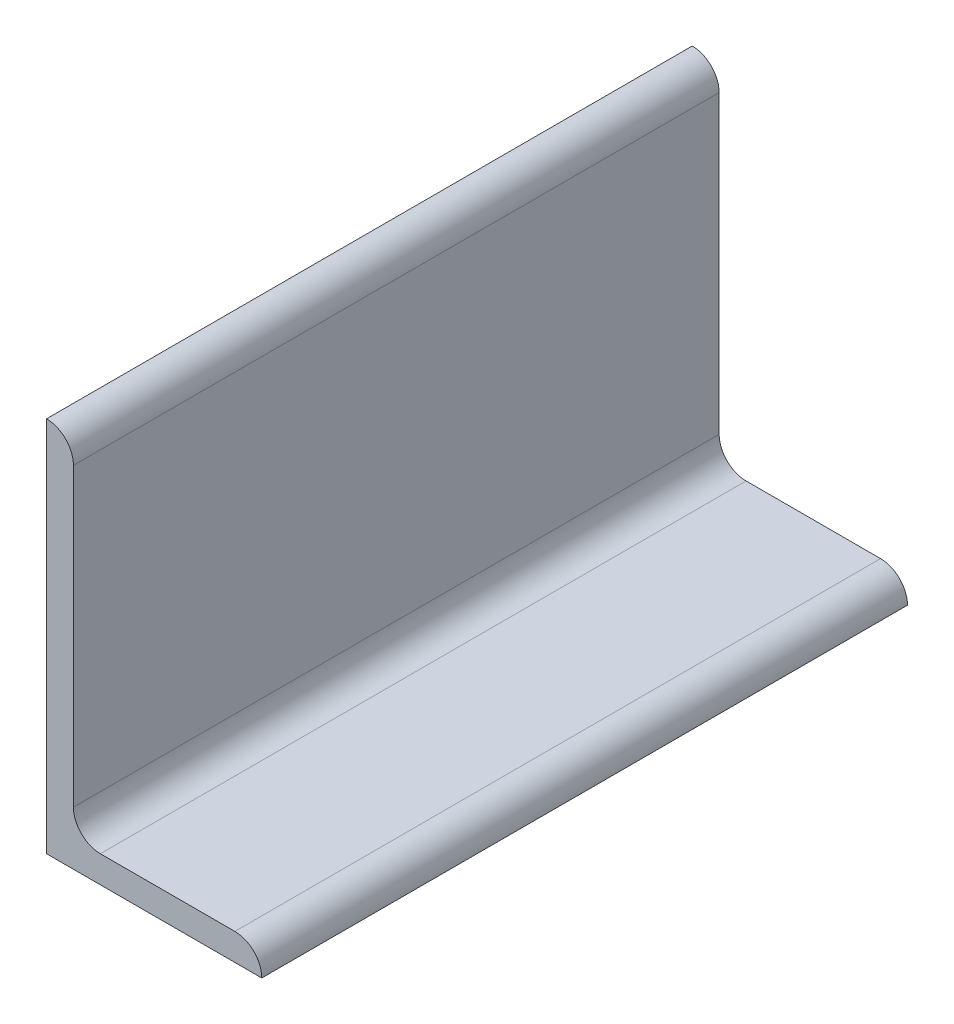
ISO-10303-21;
HEADER;
FILE_DESCRIPTION(('STEP AP214'),'2;1');
FILE_NAME('part.step','',(''),(''),'','','');
FILE_SCHEMA(('AUTOMOTIVE_DESIGN { 1 0 10303 214 1 1 1 1 }'));
ENDSEC;
DATA;
#1=APPLICATION_CONTEXT('core data for automotive mechanical design processes');
#2=APPLICATION_PROTOCOL_DEFINITION('international standard','automotive_design',2000,#1);
#3=PRODUCT_CONTEXT('',#1,'mechanical');
#4=PRODUCT('Part','Part','',(#3));
#5=PRODUCT_RELATED_PRODUCT_CATEGORY('part','',(#4));
#6=PRODUCT_DEFINITION_FORMATION('','',#4);
#7=PRODUCT_DEFINITION_CONTEXT('part definition',#1,'design');
#8=PRODUCT_DEFINITION('design','',#6,#7);
#9=PRODUCT_DEFINITION_SHAPE('','',#8);
#10=(LENGTH_UNIT() NAMED_UNIT(*) SI_UNIT(.MILLI.,.METRE.));
#11=(NAMED_UNIT(*) PLANE_ANGLE_UNIT() SI_UNIT($,.RADIAN.));
#12=(NAMED_UNIT(*) SI_UNIT($,.STERADIAN.) SOLID_ANGLE_UNIT());
#13=UNCERTAINTY_MEASURE_WITH_UNIT(LENGTH_MEASURE(1.E-05),#10,'distance_accuracy_value','');
#14=(GEOMETRIC_REPRESENTATION_CONTEXT(3) GLOBAL_UNCERTAINTY_ASSIGNED_CONTEXT((#13)) GLOBAL_UNIT_ASSIGNED_CONTEXT((#10,
#11,#12)) REPRESENTATION_CONTEXT('',''));
#15=CARTESIAN_POINT('',(0.,0.,0.));
#16=DIRECTION('',(0.,0.,1.));
#17=DIRECTION('',(1.,0.,0.));
#18=AXIS2_PLACEMENT_3D('',#15,#16,#17);
#19=CARTESIAN_POINT('',(101.6,0.,152.4));
#20=DIRECTION('',(0.,1.,0.));
#21=DIRECTION('',(-1.,0.,0.));
#22=AXIS2_PLACEMENT_3D('',#19,#20,#21);
#23=PLANE('',#22);
#24=DIRECTION('',(1.,0.,0.));
#25=VECTOR('',#24,1.);
#26=CARTESIAN_POINT('',(101.6,0.,-152.4));
#27=LINE('',#26,#25);
#28=CARTESIAN_POINT('',(0.,0.,-152.4));
#29=VERTEX_POINT('',#28);
#30=CARTESIAN_POINT('',(101.6,0.,-152.4));
#31=VERTEX_POINT('',#30);
#32=EDGE_CURVE('E119',#29,#31,#27,.T.);
#33=ORIENTED_EDGE('',*,*,#32,.T.);
#34=DIRECTION('',(0.,0.,-1.));
#35=VECTOR('',#34,1.);
#36=CARTESIAN_POINT('',(101.6,0.,152.4));
#37=LINE('',#36,#35);
#38=CARTESIAN_POINT('',(101.6,0.,152.4));
#39=VERTEX_POINT('',#38);
#40=EDGE_CURVE('E11',#39,#31,#37,.T.);
#41=ORIENTED_EDGE('',*,*,#40,.F.);
#42=DIRECTION('',(1.,0.,0.));
#43=VECTOR('',#42,1.);
#44=CARTESIAN_POINT('',(101.6,0.,152.4));
#45=LINE('',#44,#43);
#46=CARTESIAN_POINT('',(0.,0.,152.4));
#47=VERTEX_POINT('',#46);
#48=EDGE_CURVE('E135',#47,#39,#45,.T.);
#49=ORIENTED_EDGE('',*,*,#48,.F.);
#50=DIRECTION('',(0.,0.,-1.));
#51=VECTOR('',#50,1.);
#52=CARTESIAN_POINT('',(0.,0.,152.4));
#53=LINE('',#52,#51);
#54=EDGE_CURVE('E115',#47,#29,#53,.T.);
#55=ORIENTED_EDGE('',*,*,#54,.T.);
#56=EDGE_LOOP('',(#33,#41,#49,#55));
#57=FACE_BOUND('',#56,.T.);
#58=ADVANCED_FACE('F17',(#57),#23,.F.);
#59=CARTESIAN_POINT('',(101.6,0.00508000000000622,152.4));
#60=DIRECTION('',(-1.,0.,0.));
#61=DIRECTION('',(0.,0.,1.));
#62=AXIS2_PLACEMENT_3D('',#59,#60,#61);
#63=PLANE('',#62);
#64=DIRECTION('',(0.,1.,0.));
#65=VECTOR('',#64,1.);
#66=CARTESIAN_POINT('',(101.6,0.00508000000000622,-152.4));
#67=LINE('',#66,#65);
#68=CARTESIAN_POINT('',(101.6,0.00508000000000622,-152.4));
#69=VERTEX_POINT('',#68);
#70=EDGE_CURVE('E122',#31,#69,#67,.T.);
#71=ORIENTED_EDGE('',*,*,#70,.T.);
#72=DIRECTION('',(0.,0.,-1.));
#73=VECTOR('',#72,1.);
#74=CARTESIAN_POINT('',(101.6,0.00508000000000622,152.4));
#75=LINE('',#74,#73);
#76=CARTESIAN_POINT('',(101.6,0.00508000000000622,152.4));
#77=VERTEX_POINT('',#76);
#78=EDGE_CURVE('E25',#77,#69,#75,.T.);
#79=ORIENTED_EDGE('',*,*,#78,.F.);
#80=DIRECTION('',(0.,1.,0.));
#81=VECTOR('',#80,1.);
#82=CARTESIAN_POINT('',(101.6,0.00508000000000622,152.4));
#83=LINE('',#82,#81);
#84=EDGE_CURVE('E79',#39,#77,#83,.T.);
#85=ORIENTED_EDGE('',*,*,#84,.F.);
#86=ORIENTED_EDGE('',*,*,#40,.T.);
#87=EDGE_LOOP('',(#71,#79,#85,#86));
#88=FACE_BOUND('',#87,.T.);
#89=ADVANCED_FACE('F178',(#88),#63,.F.);
#90=CARTESIAN_POINT('',(88.90508,0.00508000000000467,152.4));
#91=DIRECTION('',(0.,0.,-1.));
#92=DIRECTION('',(-1.,0.,0.));
#93=AXIS2_PLACEMENT_3D('',#90,#91,#92);
#94=CYLINDRICAL_SURFACE('',#93,12.69492);
#95=CARTESIAN_POINT('',(88.90508,0.00508000000000467,-152.4));
#96=DIRECTION('',(0.,0.,1.));
#97=DIRECTION('',(1.,0.,0.));
#98=AXIS2_PLACEMENT_3D('',#95,#96,#97);
#99=CIRCLE('',#98,12.69492);
#100=CARTESIAN_POINT('',(88.90508,12.7,-152.4));
#101=VERTEX_POINT('',#100);
#102=EDGE_CURVE('E124',#69,#101,#99,.T.);
#103=ORIENTED_EDGE('',*,*,#102,.T.);
#104=DIRECTION('',(0.,0.,-1.));
#105=VECTOR('',#104,1.);
#106=CARTESIAN_POINT('',(88.90508,12.7,152.4));
#107=LINE('',#106,#105);
#108=CARTESIAN_POINT('',(88.90508,12.7,152.4));
#109=VERTEX_POINT('',#108);
#110=EDGE_CURVE('E145',#109,#101,#107,.T.);
#111=ORIENTED_EDGE('',*,*,#110,.F.);
#112=CARTESIAN_POINT('',(88.90508,0.00508000000000467,152.4));
#113=DIRECTION('',(0.,0.,1.));
#114=DIRECTION('',(1.,0.,0.));
#115=AXIS2_PLACEMENT_3D('',#112,#113,#114);
#116=CIRCLE('',#115,12.69492);
#117=EDGE_CURVE('E153',#77,#109,#116,.T.);
#118=ORIENTED_EDGE('',*,*,#117,.F.);
#119=ORIENTED_EDGE('',*,*,#78,.T.);
#120=EDGE_LOOP('',(#103,#111,#118,#119));
#121=FACE_BOUND('',#120,.T.);
#122=ADVANCED_FACE('F151',(#121),#94,.T.);
#123=CARTESIAN_POINT('',(25.4,12.7,152.4));
#124=DIRECTION('',(0.,-1.,0.));
#125=DIRECTION('',(1.,0.,0.));
#126=AXIS2_PLACEMENT_3D('',#123,#124,#125);
#127=PLANE('',#126);
#128=DIRECTION('',(-1.,0.,0.));
#129=VECTOR('',#128,1.);
#130=CARTESIAN_POINT('',(25.4,12.7,-152.4));
#131=LINE('',#130,#129);
#132=CARTESIAN_POINT('',(25.4,12.7,-152.4));
#133=VERTEX_POINT('',#132);
#134=EDGE_CURVE('E126',#101,#133,#131,.T.);
#135=ORIENTED_EDGE('',*,*,#134,.T.);
#136=DIRECTION('',(0.,0.,-1.));
#137=VECTOR('',#136,1.);
#138=CARTESIAN_POINT('',(25.4,12.7,152.4));
#139=LINE('',#138,#137);
#140=CARTESIAN_POINT('',(25.4,12.7,152.4));
#141=VERTEX_POINT('',#140);
#142=EDGE_CURVE('E142',#141,#133,#139,.T.);
#143=ORIENTED_EDGE('',*,*,#142,.F.);
#144=DIRECTION('',(-1.,0.,0.));
#145=VECTOR('',#144,1.);
#146=CARTESIAN_POINT('',(25.4,12.7,152.4));
#147=LINE('',#146,#145);
#148=EDGE_CURVE('E169',#109,#141,#147,.T.);
#149=ORIENTED_EDGE('',*,*,#148,.F.);
#150=ORIENTED_EDGE('',*,*,#110,.T.);
#151=EDGE_LOOP('',(#135,#143,#149,#150));
#152=FACE_BOUND('',#151,.T.);
#153=ADVANCED_FACE('F162',(#152),#127,.F.);
#154=CARTESIAN_POINT('',(25.4,25.4,152.4));
#155=DIRECTION('',(0.,0.,-1.));
#156=DIRECTION('',(-1.,0.,0.));
#157=AXIS2_PLACEMENT_3D('',#154,#155,#156);
#158=CYLINDRICAL_SURFACE('',#157,12.7);
#159=CARTESIAN_POINT('',(25.4,25.4,-152.4));
#160=DIRECTION('',(0.,0.,-1.));
#161=DIRECTION('',(-1.,0.,0.));
#162=AXIS2_PLACEMENT_3D('',#159,#160,#161);
#163=CIRCLE('',#162,12.7);
#164=CARTESIAN_POINT('',(12.7,25.4,-152.4));
#165=VERTEX_POINT('',#164);
#166=EDGE_CURVE('E128',#133,#165,#163,.T.);
#167=ORIENTED_EDGE('',*,*,#166,.T.);
#168=DIRECTION('',(0.,0.,-1.));
#169=VECTOR('',#168,1.);
#170=CARTESIAN_POINT('',(12.7,25.4,152.4));
#171=LINE('',#170,#169);
#172=CARTESIAN_POINT('',(12.7,25.4,152.4));
#173=VERTEX_POINT('',#172);
#174=EDGE_CURVE('E139',#173,#165,#171,.T.);
#175=ORIENTED_EDGE('',*,*,#174,.F.);
#176=CARTESIAN_POINT('',(25.4,25.4,152.4));
#177=DIRECTION('',(0.,0.,-1.));
#178=DIRECTION('',(-1.,0.,0.));
#179=AXIS2_PLACEMENT_3D('',#176,#177,#178);
#180=CIRCLE('',#179,12.7);
#181=EDGE_CURVE('E168',#141,#173,#180,.T.);
#182=ORIENTED_EDGE('',*,*,#181,.F.);
#183=ORIENTED_EDGE('',*,*,#142,.T.);
#184=EDGE_LOOP('',(#167,#175,#182,#183));
#185=FACE_BOUND('',#184,.T.);
#186=ADVANCED_FACE('F166',(#185),#158,.F.);
#187=CARTESIAN_POINT('',(12.7,165.10508,152.4));
#188=DIRECTION('',(-1.,0.,0.));
#189=DIRECTION('',(0.,-1.,0.));
#190=AXIS2_PLACEMENT_3D('',#187,#188,#189);
#191=PLANE('',#190);
#192=DIRECTION('',(0.,1.,0.));
#193=VECTOR('',#192,1.);
#194=CARTESIAN_POINT('',(12.7,165.10508,-152.4));
#195=LINE('',#194,#193);
#196=CARTESIAN_POINT('',(12.7,165.10508,-152.4));
#197=VERTEX_POINT('',#196);
#198=EDGE_CURVE('E130',#165,#197,#195,.T.);
#199=ORIENTED_EDGE('',*,*,#198,.T.);
#200=DIRECTION('',(0.,0.,-1.));
#201=VECTOR('',#200,1.);
#202=CARTESIAN_POINT('',(12.7,165.10508,152.4));
#203=LINE('',#202,#201);
#204=CARTESIAN_POINT('',(12.7,165.10508,152.4));
#205=VERTEX_POINT('',#204);
#206=EDGE_CURVE('E110',#205,#197,#203,.T.);
#207=ORIENTED_EDGE('',*,*,#206,.F.);
#208=DIRECTION('',(0.,1.,0.));
#209=VECTOR('',#208,1.);
#210=CARTESIAN_POINT('',(12.7,165.10508,152.4));
#211=LINE('',#210,#209);
#212=EDGE_CURVE('E101',#173,#205,#211,.T.);
#213=ORIENTED_EDGE('',*,*,#212,.F.);
#214=ORIENTED_EDGE('',*,*,#174,.T.);
#215=EDGE_LOOP('',(#199,#207,#213,#214));
#216=FACE_BOUND('',#215,.T.);
#217=ADVANCED_FACE('F192',(#216),#191,.F.);
#218=CARTESIAN_POINT('',(0.00508000000000078,165.10508,152.4));
#219=DIRECTION('',(0.,0.,-1.));
#220=DIRECTION('',(-1.,0.,0.));
#221=AXIS2_PLACEMENT_3D('',#218,#219,#220);
#222=CYLINDRICAL_SURFACE('',#221,12.69492);
#223=CARTESIAN_POINT('',(0.00508000000000078,165.10508,-152.4));
#224=DIRECTION('',(0.,0.,1.));
#225=DIRECTION('',(-1.,0.,0.));
#226=AXIS2_PLACEMENT_3D('',#223,#224,#225);
#227=CIRCLE('',#226,12.69492);
#228=CARTESIAN_POINT('',(0.00508,177.8,-152.4));
#229=VERTEX_POINT('',#228);
#230=EDGE_CURVE('E109',#197,#229,#227,.T.);
#231=ORIENTED_EDGE('',*,*,#230,.T.);
#232=DIRECTION('',(0.,0.,-1.));
#233=VECTOR('',#232,1.);
#234=CARTESIAN_POINT('',(0.00508,177.8,152.4));
#235=LINE('',#234,#233);
#236=CARTESIAN_POINT('',(0.00508,177.8,152.4));
#237=VERTEX_POINT('',#236);
#238=EDGE_CURVE('E106',#237,#229,#235,.T.);
#239=ORIENTED_EDGE('',*,*,#238,.F.);
#240=CARTESIAN_POINT('',(0.00508000000000078,165.10508,152.4));
#241=DIRECTION('',(0.,0.,1.));
#242=DIRECTION('',(-1.,0.,0.));
#243=AXIS2_PLACEMENT_3D('',#240,#241,#242);
#244=CIRCLE('',#243,12.69492);
#245=EDGE_CURVE('E95',#205,#237,#244,.T.);
#246=ORIENTED_EDGE('',*,*,#245,.F.);
#247=ORIENTED_EDGE('',*,*,#206,.T.);
#248=EDGE_LOOP('',(#231,#239,#246,#247));
#249=FACE_BOUND('',#248,.T.);
#250=ADVANCED_FACE('F107',(#249),#222,.T.);
#251=CARTESIAN_POINT('',(0.,177.8,152.4));
#252=DIRECTION('',(0.,-1.,0.));
#253=DIRECTION('',(0.,0.,-1.));
#254=AXIS2_PLACEMENT_3D('',#251,#252,#253);
#255=PLANE('',#254);
#256=DIRECTION('',(-1.,0.,0.));
#257=VECTOR('',#256,1.);
#258=CARTESIAN_POINT('',(0.,177.8,-152.4));
#259=LINE('',#258,#257);
#260=CARTESIAN_POINT('',(0.,177.8,-152.4));
#261=VERTEX_POINT('',#260);
#262=EDGE_CURVE('E65',#229,#261,#259,.T.);
#263=ORIENTED_EDGE('',*,*,#262,.T.);
#264=DIRECTION('',(0.,0.,-1.));
#265=VECTOR('',#264,1.);
#266=CARTESIAN_POINT('',(0.,177.8,152.4));
#267=LINE('',#266,#265);
#268=CARTESIAN_POINT('',(0.,177.8,152.4));
#269=VERTEX_POINT('',#268);
#270=EDGE_CURVE('E111',#269,#261,#267,.T.);
#271=ORIENTED_EDGE('',*,*,#270,.F.);
#272=DIRECTION('',(-1.,0.,0.));
#273=VECTOR('',#272,1.);
#274=CARTESIAN_POINT('',(0.,177.8,152.4));
#275=LINE('',#274,#273);
#276=EDGE_CURVE('E99',#237,#269,#275,.T.);
#277=ORIENTED_EDGE('',*,*,#276,.F.);
#278=ORIENTED_EDGE('',*,*,#238,.T.);
#279=EDGE_LOOP('',(#263,#271,#277,#278));
#280=FACE_BOUND('',#279,.T.);
#281=ADVANCED_FACE('F113',(#280),#255,.F.);
#282=CARTESIAN_POINT('',(0.,0.,152.4));
#283=DIRECTION('',(1.,0.,0.));
#284=DIRECTION('',(0.,0.,-1.));
#285=AXIS2_PLACEMENT_3D('',#282,#283,#284);
#286=PLANE('',#285);
#287=DIRECTION('',(0.,-1.,0.));
#288=VECTOR('',#287,1.);
#289=CARTESIAN_POINT('',(0.,0.,-152.4));
#290=LINE('',#289,#288);
#291=EDGE_CURVE('E71',#261,#29,#290,.T.);
#292=ORIENTED_EDGE('',*,*,#291,.T.);
#293=ORIENTED_EDGE('',*,*,#54,.F.);
#294=DIRECTION('',(0.,-1.,0.));
#295=VECTOR('',#294,1.);
#296=CARTESIAN_POINT('',(0.,0.,152.4));
#297=LINE('',#296,#295);
#298=EDGE_CURVE('E33',#269,#47,#297,.T.);
#299=ORIENTED_EDGE('',*,*,#298,.F.);
#300=ORIENTED_EDGE('',*,*,#270,.T.);
#301=EDGE_LOOP('',(#292,#293,#299,#300));
#302=FACE_BOUND('',#301,.T.);
#303=ADVANCED_FACE('F200',(#302),#286,.F.);
#304=CARTESIAN_POINT('',(0.00508000000000078,165.10508,152.4));
#305=DIRECTION('',(0.,0.,-1.));
#306=DIRECTION('',(-1.,0.,0.));
#307=AXIS2_PLACEMENT_3D('',#304,#305,#306);
#308=PLANE('',#307);
#309=ORIENTED_EDGE('',*,*,#48,.T.);
#310=ORIENTED_EDGE('',*,*,#84,.T.);
#311=ORIENTED_EDGE('',*,*,#117,.T.);
#312=ORIENTED_EDGE('',*,*,#148,.T.);
#313=ORIENTED_EDGE('',*,*,#181,.T.);
#314=ORIENTED_EDGE('',*,*,#212,.T.);
#315=ORIENTED_EDGE('',*,*,#245,.T.);
#316=ORIENTED_EDGE('',*,*,#276,.T.);
#317=ORIENTED_EDGE('',*,*,#298,.T.);
#318=EDGE_LOOP('',(#309,#310,#311,#312,#313,#314,#315,#316,#317));
#319=FACE_BOUND('',#318,.T.);
#320=ADVANCED_FACE('F97',(#319),#308,.F.);
#321=CARTESIAN_POINT('',(0.00508000000000078,165.10508,-152.4));
#322=DIRECTION('',(0.,0.,-1.));
#323=DIRECTION('',(-1.,0.,0.));
#324=AXIS2_PLACEMENT_3D('',#321,#322,#323);
#325=PLANE('',#324);
#326=ORIENTED_EDGE('',*,*,#32,.F.);
#327=ORIENTED_EDGE('',*,*,#291,.F.);
#328=ORIENTED_EDGE('',*,*,#262,.F.);
#329=ORIENTED_EDGE('',*,*,#230,.F.);
#330=ORIENTED_EDGE('',*,*,#198,.F.);
#331=ORIENTED_EDGE('',*,*,#166,.F.);
#332=ORIENTED_EDGE('',*,*,#134,.F.);
#333=ORIENTED_EDGE('',*,*,#102,.F.);
#334=ORIENTED_EDGE('',*,*,#70,.F.);
#335=EDGE_LOOP('',(#326,#327,#328,#329,#330,#331,#332,#333,#334));
#336=FACE_BOUND('',#335,.T.);
#337=ADVANCED_FACE('F157',(#336),#325,.T.);
#338=CLOSED_SHELL('',(#58,#89,#122,#153,#186,#217,#250,#281,#303,#320,#337));
#339=MANIFOLD_SOLID_BREP('B1',#338);
#340=ADVANCED_BREP_SHAPE_REPRESENTATION('',(#18,#339),#14);
#341=SHAPE_DEFINITION_REPRESENTATION(#9,#340);
ENDSEC;
END-ISO-10303-21;
